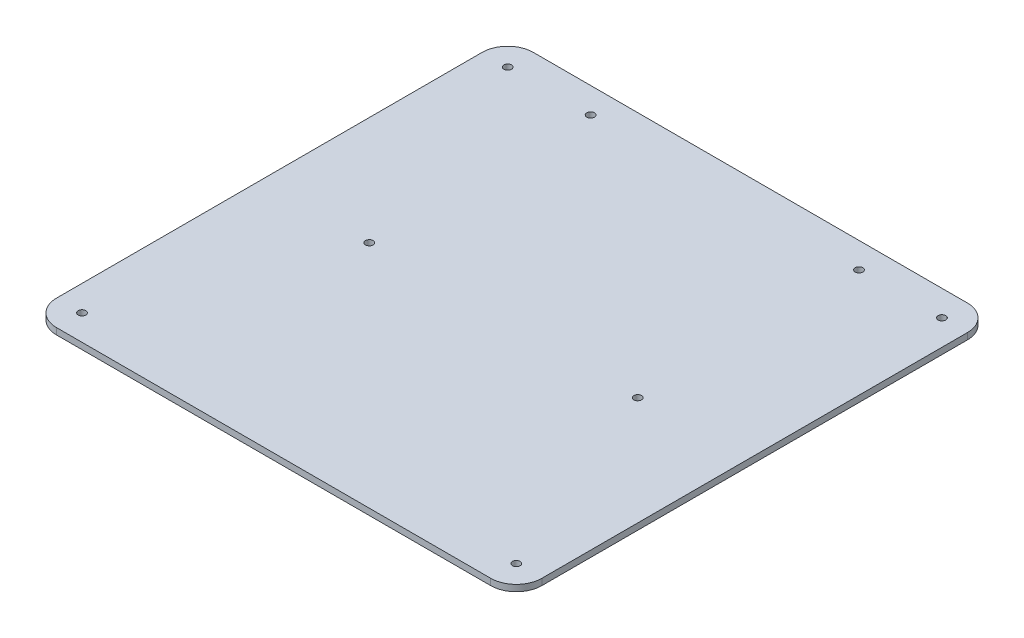
ISO-10303-21;
HEADER;
FILE_DESCRIPTION(('STEP AP214'),'2;1');
FILE_NAME('part.step','',(''),(''),'','','');
FILE_SCHEMA(('AUTOMOTIVE_DESIGN { 1 0 10303 214 1 1 1 1 }'));
ENDSEC;
DATA;
#1=APPLICATION_CONTEXT('core data for automotive mechanical design processes');
#2=APPLICATION_PROTOCOL_DEFINITION('international standard','automotive_design',2000,#1);
#3=PRODUCT_CONTEXT('',#1,'mechanical');
#4=PRODUCT('Part','Part','',(#3));
#5=PRODUCT_RELATED_PRODUCT_CATEGORY('part','',(#4));
#6=PRODUCT_DEFINITION_FORMATION('','',#4);
#7=PRODUCT_DEFINITION_CONTEXT('part definition',#1,'design');
#8=PRODUCT_DEFINITION('design','',#6,#7);
#9=PRODUCT_DEFINITION_SHAPE('','',#8);
#10=(LENGTH_UNIT() NAMED_UNIT(*) SI_UNIT(.MILLI.,.METRE.));
#11=(NAMED_UNIT(*) PLANE_ANGLE_UNIT() SI_UNIT($,.RADIAN.));
#12=(NAMED_UNIT(*) SI_UNIT($,.STERADIAN.) SOLID_ANGLE_UNIT());
#13=UNCERTAINTY_MEASURE_WITH_UNIT(LENGTH_MEASURE(1.E-05),#10,'distance_accuracy_value','');
#14=(GEOMETRIC_REPRESENTATION_CONTEXT(3) GLOBAL_UNCERTAINTY_ASSIGNED_CONTEXT((#13)) GLOBAL_UNIT_ASSIGNED_CONTEXT((#10,
#11,#12)) REPRESENTATION_CONTEXT('',''));
#15=CARTESIAN_POINT('',(0.,0.,0.));
#16=DIRECTION('',(0.,0.,1.));
#17=DIRECTION('',(1.,0.,0.));
#18=AXIS2_PLACEMENT_3D('',#15,#16,#17);
#19=CARTESIAN_POINT('',(-168.099479224988,69.6371137303564,-29.9177020021704));
#20=DIRECTION('',(0.,-1.,0.));
#21=DIRECTION('',(0.,0.,-1.));
#22=AXIS2_PLACEMENT_3D('',#19,#20,#21);
#23=PLANE('',#22);
#24=CARTESIAN_POINT('',(-168.099479224988,69.6371137303564,-29.9177020021704));
#25=DIRECTION('',(0.,1.,0.));
#26=DIRECTION('',(0.,0.,-1.));
#27=AXIS2_PLACEMENT_3D('',#24,#25,#26);
#28=CIRCLE('',#27,10.);
#29=CARTESIAN_POINT('',(-168.099479224988,69.6371137303564,-39.9177020021704));
#30=VERTEX_POINT('',#29);
#31=CARTESIAN_POINT('',(-178.099479224988,69.6371137303564,-29.9177020021704));
#32=VERTEX_POINT('',#31);
#33=EDGE_CURVE('E145',#30,#32,#28,.T.);
#34=ORIENTED_EDGE('',*,*,#33,.T.);
#35=DIRECTION('',(0.,0.,1.));
#36=VECTOR('',#35,1.);
#37=CARTESIAN_POINT('',(-178.099479224988,69.6371137303564,-29.9177020021704));
#38=LINE('',#37,#36);
#39=CARTESIAN_POINT('',(-178.099479224988,69.6371137303564,136.727321583706));
#40=VERTEX_POINT('',#39);
#41=EDGE_CURVE('E93',#32,#40,#38,.T.);
#42=ORIENTED_EDGE('',*,*,#41,.T.);
#43=CARTESIAN_POINT('',(-168.099479224988,69.6371137303564,136.727321583706));
#44=DIRECTION('',(0.,1.,0.));
#45=DIRECTION('',(0.,0.,1.));
#46=AXIS2_PLACEMENT_3D('',#43,#44,#45);
#47=CIRCLE('',#46,10.);
#48=CARTESIAN_POINT('',(-168.099479224988,69.6371137303564,146.727321583706));
#49=VERTEX_POINT('',#48);
#50=EDGE_CURVE('E160',#40,#49,#47,.T.);
#51=ORIENTED_EDGE('',*,*,#50,.T.);
#52=DIRECTION('',(1.,0.,0.));
#53=VECTOR('',#52,1.);
#54=CARTESIAN_POINT('',(1.90052077501147,69.6371137303564,146.727321583706));
#55=LINE('',#54,#53);
#56=CARTESIAN_POINT('',(1.90052077501147,69.6371137303564,146.727321583706));
#57=VERTEX_POINT('',#56);
#58=EDGE_CURVE('E173',#49,#57,#55,.T.);
#59=ORIENTED_EDGE('',*,*,#58,.T.);
#60=CARTESIAN_POINT('',(1.90052077501154,69.6371137303564,136.727321583706));
#61=DIRECTION('',(0.,1.,0.));
#62=DIRECTION('',(0.,0.,1.));
#63=AXIS2_PLACEMENT_3D('',#60,#61,#62);
#64=CIRCLE('',#63,10.);
#65=CARTESIAN_POINT('',(11.9005207750115,69.6371137303564,136.727321583706));
#66=VERTEX_POINT('',#65);
#67=EDGE_CURVE('E112',#57,#66,#64,.T.);
#68=ORIENTED_EDGE('',*,*,#67,.T.);
#69=DIRECTION('',(0.,0.,-1.));
#70=VECTOR('',#69,1.);
#71=CARTESIAN_POINT('',(11.9005207750115,69.6371137303564,-29.9177020021704));
#72=LINE('',#71,#70);
#73=CARTESIAN_POINT('',(11.9005207750115,69.6371137303564,-29.9177020021704));
#74=VERTEX_POINT('',#73);
#75=EDGE_CURVE('E106',#66,#74,#72,.T.);
#76=ORIENTED_EDGE('',*,*,#75,.T.);
#77=CARTESIAN_POINT('',(1.90052077501151,69.6371137303564,-29.9177020021704));
#78=DIRECTION('',(0.,1.,0.));
#79=DIRECTION('',(0.,0.,-1.));
#80=AXIS2_PLACEMENT_3D('',#77,#78,#79);
#81=CIRCLE('',#80,10.);
#82=CARTESIAN_POINT('',(1.90052077501151,69.6371137303564,-39.9177020021704));
#83=VERTEX_POINT('',#82);
#84=EDGE_CURVE('E110',#74,#83,#81,.T.);
#85=ORIENTED_EDGE('',*,*,#84,.T.);
#86=DIRECTION('',(-1.,0.,0.));
#87=VECTOR('',#86,1.);
#88=CARTESIAN_POINT('',(1.90052077501151,69.6371137303564,-39.9177020021704));
#89=LINE('',#88,#87);
#90=EDGE_CURVE('E50',#83,#30,#89,.T.);
#91=ORIENTED_EDGE('',*,*,#90,.T.);
#92=EDGE_LOOP('',(#34,#42,#51,#59,#68,#76,#85,#91));
#93=FACE_BOUND('',#92,.T.);
#94=CARTESIAN_POINT('',(-30.5685157154369,69.6371137303564,-29.9177020021704));
#95=DIRECTION('',(0.,1.,0.));
#96=DIRECTION('',(0.,0.,1.));
#97=AXIS2_PLACEMENT_3D('',#94,#95,#96);
#98=CIRCLE('',#97,1.5);
#99=CARTESIAN_POINT('',(-30.5685157154369,69.6371137303564,-28.4177020021704));
#100=VERTEX_POINT('',#99);
#101=EDGE_CURVE('E134',#100,#100,#98,.T.);
#102=ORIENTED_EDGE('',*,*,#101,.F.);
#103=EDGE_LOOP('',(#102));
#104=FACE_BOUND('',#103,.T.);
#105=CARTESIAN_POINT('',(-135.63044273454,69.6371137303564,-29.9177020021704));
#106=DIRECTION('',(0.,1.,0.));
#107=DIRECTION('',(0.,0.,1.));
#108=AXIS2_PLACEMENT_3D('',#105,#106,#107);
#109=CIRCLE('',#108,1.5);
#110=CARTESIAN_POINT('',(-135.63044273454,69.6371137303564,-28.4177020021704));
#111=VERTEX_POINT('',#110);
#112=EDGE_CURVE('E182',#111,#111,#109,.T.);
#113=ORIENTED_EDGE('',*,*,#112,.F.);
#114=EDGE_LOOP('',(#113));
#115=FACE_BOUND('',#114,.T.);
#116=CARTESIAN_POINT('',(-135.63044273454,69.6371137303564,56.7273215837061));
#117=DIRECTION('',(0.,1.,0.));
#118=DIRECTION('',(0.,0.,1.));
#119=AXIS2_PLACEMENT_3D('',#116,#117,#118);
#120=CIRCLE('',#119,1.5);
#121=CARTESIAN_POINT('',(-135.63044273454,69.6371137303564,58.2273215837061));
#122=VERTEX_POINT('',#121);
#123=EDGE_CURVE('E188',#122,#122,#120,.T.);
#124=ORIENTED_EDGE('',*,*,#123,.F.);
#125=EDGE_LOOP('',(#124));
#126=FACE_BOUND('',#125,.T.);
#127=CARTESIAN_POINT('',(-30.5685157154369,69.6371137303564,56.7273215837061));
#128=DIRECTION('',(0.,1.,0.));
#129=DIRECTION('',(0.,0.,1.));
#130=AXIS2_PLACEMENT_3D('',#127,#128,#129);
#131=CIRCLE('',#130,1.5);
#132=CARTESIAN_POINT('',(-30.5685157154369,69.6371137303564,58.2273215837061));
#133=VERTEX_POINT('',#132);
#134=EDGE_CURVE('E194',#133,#133,#131,.T.);
#135=ORIENTED_EDGE('',*,*,#134,.F.);
#136=EDGE_LOOP('',(#135));
#137=FACE_BOUND('',#136,.T.);
#138=CARTESIAN_POINT('',(1.90052077501151,69.6371137303564,-29.9177020021704));
#139=DIRECTION('',(0.,1.,0.));
#140=DIRECTION('',(0.,0.,1.));
#141=AXIS2_PLACEMENT_3D('',#138,#139,#140);
#142=CIRCLE('',#141,1.5);
#143=CARTESIAN_POINT('',(1.90052077501151,69.6371137303564,-28.4177020021704));
#144=VERTEX_POINT('',#143);
#145=EDGE_CURVE('E200',#144,#144,#142,.T.);
#146=ORIENTED_EDGE('',*,*,#145,.F.);
#147=EDGE_LOOP('',(#146));
#148=FACE_BOUND('',#147,.T.);
#149=CARTESIAN_POINT('',(1.90052077501154,69.6371137303564,136.727321583706));
#150=DIRECTION('',(0.,1.,0.));
#151=DIRECTION('',(0.,0.,1.));
#152=AXIS2_PLACEMENT_3D('',#149,#150,#151);
#153=CIRCLE('',#152,1.5);
#154=CARTESIAN_POINT('',(1.90052077501154,69.6371137303564,138.227321583706));
#155=VERTEX_POINT('',#154);
#156=EDGE_CURVE('E206',#155,#155,#153,.T.);
#157=ORIENTED_EDGE('',*,*,#156,.F.);
#158=EDGE_LOOP('',(#157));
#159=FACE_BOUND('',#158,.T.);
#160=CARTESIAN_POINT('',(-168.099479224988,69.6371137303564,136.727321583706));
#161=DIRECTION('',(0.,1.,0.));
#162=DIRECTION('',(0.,0.,1.));
#163=AXIS2_PLACEMENT_3D('',#160,#161,#162);
#164=CIRCLE('',#163,1.5);
#165=CARTESIAN_POINT('',(-168.099479224988,69.6371137303564,138.227321583706));
#166=VERTEX_POINT('',#165);
#167=EDGE_CURVE('E212',#166,#166,#164,.T.);
#168=ORIENTED_EDGE('',*,*,#167,.F.);
#169=EDGE_LOOP('',(#168));
#170=FACE_BOUND('',#169,.T.);
#171=CARTESIAN_POINT('',(-168.099479224988,69.6371137303564,-29.9177020021704));
#172=DIRECTION('',(0.,1.,0.));
#173=DIRECTION('',(0.,0.,1.));
#174=AXIS2_PLACEMENT_3D('',#171,#172,#173);
#175=CIRCLE('',#174,1.5);
#176=CARTESIAN_POINT('',(-168.099479224988,69.6371137303564,-28.4177020021704));
#177=VERTEX_POINT('',#176);
#178=EDGE_CURVE('E218',#177,#177,#175,.T.);
#179=ORIENTED_EDGE('',*,*,#178,.F.);
#180=EDGE_LOOP('',(#179));
#181=FACE_BOUND('',#180,.T.);
#182=ADVANCED_FACE('F33',(#93,#104,#115,#126,#137,#148,#159,#170,#181),#23,.F.);
#183=CARTESIAN_POINT('',(-168.099479224988,67.1371137303564,-29.9177020021704));
#184=DIRECTION('',(0.,-1.,0.));
#185=DIRECTION('',(0.,0.,-1.));
#186=AXIS2_PLACEMENT_3D('',#183,#184,#185);
#187=PLANE('',#186);
#188=CARTESIAN_POINT('',(-168.099479224988,67.1371137303564,136.727321583706));
#189=DIRECTION('',(0.,1.,0.));
#190=DIRECTION('',(0.,0.,1.));
#191=AXIS2_PLACEMENT_3D('',#188,#189,#190);
#192=CIRCLE('',#191,1.5);
#193=CARTESIAN_POINT('',(-168.099479224988,67.1371137303564,138.227321583706));
#194=VERTEX_POINT('',#193);
#195=EDGE_CURVE('E215',#194,#194,#192,.T.);
#196=ORIENTED_EDGE('',*,*,#195,.T.);
#197=EDGE_LOOP('',(#196));
#198=FACE_BOUND('',#197,.T.);
#199=CARTESIAN_POINT('',(1.90052077501151,67.1371137303564,-29.9177020021704));
#200=DIRECTION('',(0.,1.,0.));
#201=DIRECTION('',(0.,0.,1.));
#202=AXIS2_PLACEMENT_3D('',#199,#200,#201);
#203=CIRCLE('',#202,1.5);
#204=CARTESIAN_POINT('',(1.90052077501151,67.1371137303564,-28.4177020021704));
#205=VERTEX_POINT('',#204);
#206=EDGE_CURVE('E203',#205,#205,#203,.T.);
#207=ORIENTED_EDGE('',*,*,#206,.T.);
#208=EDGE_LOOP('',(#207));
#209=FACE_BOUND('',#208,.T.);
#210=CARTESIAN_POINT('',(-135.63044273454,67.1371137303564,56.7273215837061));
#211=DIRECTION('',(0.,1.,0.));
#212=DIRECTION('',(0.,0.,1.));
#213=AXIS2_PLACEMENT_3D('',#210,#211,#212);
#214=CIRCLE('',#213,1.5);
#215=CARTESIAN_POINT('',(-135.63044273454,67.1371137303564,58.2273215837061));
#216=VERTEX_POINT('',#215);
#217=EDGE_CURVE('E191',#216,#216,#214,.T.);
#218=ORIENTED_EDGE('',*,*,#217,.T.);
#219=EDGE_LOOP('',(#218));
#220=FACE_BOUND('',#219,.T.);
#221=CARTESIAN_POINT('',(-30.5685157154369,67.1371137303564,-29.9177020021704));
#222=DIRECTION('',(0.,1.,0.));
#223=DIRECTION('',(0.,0.,1.));
#224=AXIS2_PLACEMENT_3D('',#221,#222,#223);
#225=CIRCLE('',#224,1.5);
#226=CARTESIAN_POINT('',(-30.5685157154369,67.1371137303564,-28.4177020021704));
#227=VERTEX_POINT('',#226);
#228=EDGE_CURVE('E179',#227,#227,#225,.T.);
#229=ORIENTED_EDGE('',*,*,#228,.T.);
#230=EDGE_LOOP('',(#229));
#231=FACE_BOUND('',#230,.T.);
#232=CARTESIAN_POINT('',(-168.099479224988,67.1371137303564,-29.9177020021704));
#233=DIRECTION('',(0.,1.,0.));
#234=DIRECTION('',(0.,0.,-1.));
#235=AXIS2_PLACEMENT_3D('',#232,#233,#234);
#236=CIRCLE('',#235,10.);
#237=CARTESIAN_POINT('',(-168.099479224988,67.1371137303564,-39.9177020021704));
#238=VERTEX_POINT('',#237);
#239=CARTESIAN_POINT('',(-178.099479224988,67.1371137303564,-29.9177020021704));
#240=VERTEX_POINT('',#239);
#241=EDGE_CURVE('E130',#238,#240,#236,.T.);
#242=ORIENTED_EDGE('',*,*,#241,.F.);
#243=DIRECTION('',(-1.,0.,0.));
#244=VECTOR('',#243,1.);
#245=CARTESIAN_POINT('',(1.90052077501151,67.1371137303564,-39.9177020021704));
#246=LINE('',#245,#244);
#247=CARTESIAN_POINT('',(1.90052077501151,67.1371137303564,-39.9177020021704));
#248=VERTEX_POINT('',#247);
#249=EDGE_CURVE('E85',#248,#238,#246,.T.);
#250=ORIENTED_EDGE('',*,*,#249,.F.);
#251=CARTESIAN_POINT('',(1.90052077501151,67.1371137303564,-29.9177020021704));
#252=DIRECTION('',(0.,1.,0.));
#253=DIRECTION('',(0.,0.,-1.));
#254=AXIS2_PLACEMENT_3D('',#251,#252,#253);
#255=CIRCLE('',#254,10.);
#256=CARTESIAN_POINT('',(11.9005207750115,67.1371137303564,-29.9177020021704));
#257=VERTEX_POINT('',#256);
#258=EDGE_CURVE('E79',#257,#248,#255,.T.);
#259=ORIENTED_EDGE('',*,*,#258,.F.);
#260=DIRECTION('',(0.,0.,-1.));
#261=VECTOR('',#260,1.);
#262=CARTESIAN_POINT('',(11.9005207750115,67.1371137303564,-29.9177020021704));
#263=LINE('',#262,#261);
#264=CARTESIAN_POINT('',(11.9005207750115,67.1371137303564,136.727321583706));
#265=VERTEX_POINT('',#264);
#266=EDGE_CURVE('E120',#265,#257,#263,.T.);
#267=ORIENTED_EDGE('',*,*,#266,.F.);
#268=CARTESIAN_POINT('',(1.90052077501154,67.1371137303564,136.727321583706));
#269=DIRECTION('',(0.,1.,0.));
#270=DIRECTION('',(0.,0.,1.));
#271=AXIS2_PLACEMENT_3D('',#268,#269,#270);
#272=CIRCLE('',#271,10.);
#273=CARTESIAN_POINT('',(1.90052077501147,67.1371137303564,146.727321583706));
#274=VERTEX_POINT('',#273);
#275=EDGE_CURVE('E140',#274,#265,#272,.T.);
#276=ORIENTED_EDGE('',*,*,#275,.F.);
#277=DIRECTION('',(1.,0.,0.));
#278=VECTOR('',#277,1.);
#279=CARTESIAN_POINT('',(1.90052077501147,67.1371137303564,146.727321583706));
#280=LINE('',#279,#278);
#281=CARTESIAN_POINT('',(-168.099479224988,67.1371137303564,146.727321583706));
#282=VERTEX_POINT('',#281);
#283=EDGE_CURVE('E138',#282,#274,#280,.T.);
#284=ORIENTED_EDGE('',*,*,#283,.F.);
#285=CARTESIAN_POINT('',(-168.099479224988,67.1371137303564,136.727321583706));
#286=DIRECTION('',(0.,1.,0.));
#287=DIRECTION('',(0.,0.,1.));
#288=AXIS2_PLACEMENT_3D('',#285,#286,#287);
#289=CIRCLE('',#288,10.);
#290=CARTESIAN_POINT('',(-178.099479224988,67.1371137303564,136.727321583706));
#291=VERTEX_POINT('',#290);
#292=EDGE_CURVE('E136',#291,#282,#289,.T.);
#293=ORIENTED_EDGE('',*,*,#292,.F.);
#294=DIRECTION('',(0.,0.,1.));
#295=VECTOR('',#294,1.);
#296=CARTESIAN_POINT('',(-178.099479224988,67.1371137303564,-29.9177020021704));
#297=LINE('',#296,#295);
#298=EDGE_CURVE('E133',#240,#291,#297,.T.);
#299=ORIENTED_EDGE('',*,*,#298,.F.);
#300=EDGE_LOOP('',(#242,#250,#259,#267,#276,#284,#293,#299));
#301=FACE_BOUND('',#300,.T.);
#302=CARTESIAN_POINT('',(-135.63044273454,67.1371137303564,-29.9177020021704));
#303=DIRECTION('',(0.,1.,0.));
#304=DIRECTION('',(0.,0.,1.));
#305=AXIS2_PLACEMENT_3D('',#302,#303,#304);
#306=CIRCLE('',#305,1.5);
#307=CARTESIAN_POINT('',(-135.63044273454,67.1371137303564,-28.4177020021704));
#308=VERTEX_POINT('',#307);
#309=EDGE_CURVE('E185',#308,#308,#306,.T.);
#310=ORIENTED_EDGE('',*,*,#309,.T.);
#311=EDGE_LOOP('',(#310));
#312=FACE_BOUND('',#311,.T.);
#313=CARTESIAN_POINT('',(-30.5685157154369,67.1371137303564,56.7273215837061));
#314=DIRECTION('',(0.,1.,0.));
#315=DIRECTION('',(0.,0.,1.));
#316=AXIS2_PLACEMENT_3D('',#313,#314,#315);
#317=CIRCLE('',#316,1.5);
#318=CARTESIAN_POINT('',(-30.5685157154369,67.1371137303564,58.2273215837061));
#319=VERTEX_POINT('',#318);
#320=EDGE_CURVE('E197',#319,#319,#317,.T.);
#321=ORIENTED_EDGE('',*,*,#320,.T.);
#322=EDGE_LOOP('',(#321));
#323=FACE_BOUND('',#322,.T.);
#324=CARTESIAN_POINT('',(1.90052077501154,67.1371137303564,136.727321583706));
#325=DIRECTION('',(0.,1.,0.));
#326=DIRECTION('',(0.,0.,1.));
#327=AXIS2_PLACEMENT_3D('',#324,#325,#326);
#328=CIRCLE('',#327,1.5);
#329=CARTESIAN_POINT('',(1.90052077501154,67.1371137303564,138.227321583706));
#330=VERTEX_POINT('',#329);
#331=EDGE_CURVE('E209',#330,#330,#328,.T.);
#332=ORIENTED_EDGE('',*,*,#331,.T.);
#333=EDGE_LOOP('',(#332));
#334=FACE_BOUND('',#333,.T.);
#335=CARTESIAN_POINT('',(-168.099479224988,67.1371137303564,-29.9177020021704));
#336=DIRECTION('',(0.,1.,0.));
#337=DIRECTION('',(0.,0.,1.));
#338=AXIS2_PLACEMENT_3D('',#335,#336,#337);
#339=CIRCLE('',#338,1.5);
#340=CARTESIAN_POINT('',(-168.099479224988,67.1371137303564,-28.4177020021704));
#341=VERTEX_POINT('',#340);
#342=EDGE_CURVE('E221',#341,#341,#339,.T.);
#343=ORIENTED_EDGE('',*,*,#342,.T.);
#344=EDGE_LOOP('',(#343));
#345=FACE_BOUND('',#344,.T.);
#346=ADVANCED_FACE('F164',(#198,#209,#220,#231,#301,#312,#323,#334,#345),#187,.T.);
#347=CARTESIAN_POINT('',(-168.099479224988,69.6371137303564,-29.9177020021704));
#348=DIRECTION('',(0.,-1.,0.));
#349=DIRECTION('',(0.,0.,-1.));
#350=AXIS2_PLACEMENT_3D('',#347,#348,#349);
#351=CYLINDRICAL_SURFACE('',#350,10.);
#352=ORIENTED_EDGE('',*,*,#241,.T.);
#353=DIRECTION('',(0.,-1.,0.));
#354=VECTOR('',#353,1.);
#355=CARTESIAN_POINT('',(-178.099479224988,69.6371137303564,-29.9177020021704));
#356=LINE('',#355,#354);
#357=EDGE_CURVE('E11',#32,#240,#356,.T.);
#358=ORIENTED_EDGE('',*,*,#357,.F.);
#359=ORIENTED_EDGE('',*,*,#33,.F.);
#360=DIRECTION('',(0.,-1.,0.));
#361=VECTOR('',#360,1.);
#362=CARTESIAN_POINT('',(-168.099479224988,69.6371137303564,-39.9177020021704));
#363=LINE('',#362,#361);
#364=EDGE_CURVE('E126',#30,#238,#363,.T.);
#365=ORIENTED_EDGE('',*,*,#364,.T.);
#366=EDGE_LOOP('',(#352,#358,#359,#365));
#367=FACE_BOUND('',#366,.T.);
#368=ADVANCED_FACE('F35',(#367),#351,.T.);
#369=CARTESIAN_POINT('',(-178.099479224988,69.6371137303564,-29.9177020021704));
#370=DIRECTION('',(1.,0.,0.));
#371=DIRECTION('',(0.,0.,-1.));
#372=AXIS2_PLACEMENT_3D('',#369,#370,#371);
#373=PLANE('',#372);
#374=ORIENTED_EDGE('',*,*,#298,.T.);
#375=DIRECTION('',(0.,-1.,0.));
#376=VECTOR('',#375,1.);
#377=CARTESIAN_POINT('',(-178.099479224988,69.6371137303564,136.727321583706));
#378=LINE('',#377,#376);
#379=EDGE_CURVE('E42',#40,#291,#378,.T.);
#380=ORIENTED_EDGE('',*,*,#379,.F.);
#381=ORIENTED_EDGE('',*,*,#41,.F.);
#382=ORIENTED_EDGE('',*,*,#357,.T.);
#383=EDGE_LOOP('',(#374,#380,#381,#382));
#384=FACE_BOUND('',#383,.T.);
#385=ADVANCED_FACE('F253',(#384),#373,.F.);
#386=CARTESIAN_POINT('',(-168.099479224988,69.6371137303564,136.727321583706));
#387=DIRECTION('',(0.,-1.,0.));
#388=DIRECTION('',(0.,0.,-1.));
#389=AXIS2_PLACEMENT_3D('',#386,#387,#388);
#390=CYLINDRICAL_SURFACE('',#389,10.);
#391=ORIENTED_EDGE('',*,*,#292,.T.);
#392=DIRECTION('',(0.,-1.,0.));
#393=VECTOR('',#392,1.);
#394=CARTESIAN_POINT('',(-168.099479224988,69.6371137303564,146.727321583706));
#395=LINE('',#394,#393);
#396=EDGE_CURVE('E152',#49,#282,#395,.T.);
#397=ORIENTED_EDGE('',*,*,#396,.F.);
#398=ORIENTED_EDGE('',*,*,#50,.F.);
#399=ORIENTED_EDGE('',*,*,#379,.T.);
#400=EDGE_LOOP('',(#391,#397,#398,#399));
#401=FACE_BOUND('',#400,.T.);
#402=ADVANCED_FACE('F158',(#401),#390,.T.);
#403=CARTESIAN_POINT('',(1.90052077501147,69.6371137303564,146.727321583706));
#404=DIRECTION('',(0.,0.,-1.));
#405=DIRECTION('',(-1.,0.,0.));
#406=AXIS2_PLACEMENT_3D('',#403,#404,#405);
#407=PLANE('',#406);
#408=ORIENTED_EDGE('',*,*,#283,.T.);
#409=DIRECTION('',(0.,-1.,0.));
#410=VECTOR('',#409,1.);
#411=CARTESIAN_POINT('',(1.90052077501147,69.6371137303564,146.727321583706));
#412=LINE('',#411,#410);
#413=EDGE_CURVE('E149',#57,#274,#412,.T.);
#414=ORIENTED_EDGE('',*,*,#413,.F.);
#415=ORIENTED_EDGE('',*,*,#58,.F.);
#416=ORIENTED_EDGE('',*,*,#396,.T.);
#417=EDGE_LOOP('',(#408,#414,#415,#416));
#418=FACE_BOUND('',#417,.T.);
#419=ADVANCED_FACE('F169',(#418),#407,.F.);
#420=CARTESIAN_POINT('',(1.90052077501154,69.6371137303564,136.727321583706));
#421=DIRECTION('',(0.,-1.,0.));
#422=DIRECTION('',(0.,0.,-1.));
#423=AXIS2_PLACEMENT_3D('',#420,#421,#422);
#424=CYLINDRICAL_SURFACE('',#423,10.);
#425=ORIENTED_EDGE('',*,*,#275,.T.);
#426=DIRECTION('',(0.,-1.,0.));
#427=VECTOR('',#426,1.);
#428=CARTESIAN_POINT('',(11.9005207750115,69.6371137303564,136.727321583706));
#429=LINE('',#428,#427);
#430=EDGE_CURVE('E121',#66,#265,#429,.T.);
#431=ORIENTED_EDGE('',*,*,#430,.F.);
#432=ORIENTED_EDGE('',*,*,#67,.F.);
#433=ORIENTED_EDGE('',*,*,#413,.T.);
#434=EDGE_LOOP('',(#425,#431,#432,#433));
#435=FACE_BOUND('',#434,.T.);
#436=ADVANCED_FACE('F172',(#435),#424,.T.);
#437=CARTESIAN_POINT('',(11.9005207750115,69.6371137303564,-29.9177020021704));
#438=DIRECTION('',(-1.,0.,0.));
#439=DIRECTION('',(0.,0.,1.));
#440=AXIS2_PLACEMENT_3D('',#437,#438,#439);
#441=PLANE('',#440);
#442=ORIENTED_EDGE('',*,*,#266,.T.);
#443=DIRECTION('',(0.,-1.,0.));
#444=VECTOR('',#443,1.);
#445=CARTESIAN_POINT('',(11.9005207750115,69.6371137303564,-29.9177020021704));
#446=LINE('',#445,#444);
#447=EDGE_CURVE('E117',#74,#257,#446,.T.);
#448=ORIENTED_EDGE('',*,*,#447,.F.);
#449=ORIENTED_EDGE('',*,*,#75,.F.);
#450=ORIENTED_EDGE('',*,*,#430,.T.);
#451=EDGE_LOOP('',(#442,#448,#449,#450));
#452=FACE_BOUND('',#451,.T.);
#453=ADVANCED_FACE('F118',(#452),#441,.F.);
#454=CARTESIAN_POINT('',(1.90052077501151,69.6371137303564,-29.9177020021704));
#455=DIRECTION('',(0.,-1.,0.));
#456=DIRECTION('',(0.,0.,-1.));
#457=AXIS2_PLACEMENT_3D('',#454,#455,#456);
#458=CYLINDRICAL_SURFACE('',#457,10.);
#459=ORIENTED_EDGE('',*,*,#258,.T.);
#460=DIRECTION('',(0.,-1.,0.));
#461=VECTOR('',#460,1.);
#462=CARTESIAN_POINT('',(1.90052077501151,69.6371137303564,-39.9177020021704));
#463=LINE('',#462,#461);
#464=EDGE_CURVE('E122',#83,#248,#463,.T.);
#465=ORIENTED_EDGE('',*,*,#464,.F.);
#466=ORIENTED_EDGE('',*,*,#84,.F.);
#467=ORIENTED_EDGE('',*,*,#447,.T.);
#468=EDGE_LOOP('',(#459,#465,#466,#467));
#469=FACE_BOUND('',#468,.T.);
#470=ADVANCED_FACE('F124',(#469),#458,.T.);
#471=CARTESIAN_POINT('',(1.90052077501151,69.6371137303564,-39.9177020021704));
#472=DIRECTION('',(0.,0.,1.));
#473=DIRECTION('',(1.,0.,0.));
#474=AXIS2_PLACEMENT_3D('',#471,#472,#473);
#475=PLANE('',#474);
#476=ORIENTED_EDGE('',*,*,#249,.T.);
#477=ORIENTED_EDGE('',*,*,#364,.F.);
#478=ORIENTED_EDGE('',*,*,#90,.F.);
#479=ORIENTED_EDGE('',*,*,#464,.T.);
#480=EDGE_LOOP('',(#476,#477,#478,#479));
#481=FACE_BOUND('',#480,.T.);
#482=ADVANCED_FACE('F241',(#481),#475,.F.);
#483=CARTESIAN_POINT('',(-30.5685157154369,69.6371137303564,-29.9177020021704));
#484=DIRECTION('',(0.,-1.,0.));
#485=DIRECTION('',(0.,0.,-1.));
#486=AXIS2_PLACEMENT_3D('',#483,#484,#485);
#487=CYLINDRICAL_SURFACE('',#486,1.5);
#488=ORIENTED_EDGE('',*,*,#101,.T.);
#489=EDGE_LOOP('',(#488));
#490=FACE_BOUND('',#489,.T.);
#491=ORIENTED_EDGE('',*,*,#228,.F.);
#492=EDGE_LOOP('',(#491));
#493=FACE_BOUND('',#492,.T.);
#494=ADVANCED_FACE('F238',(#490,#493),#487,.F.);
#495=CARTESIAN_POINT('',(-135.63044273454,69.6371137303564,-29.9177020021704));
#496=DIRECTION('',(0.,-1.,0.));
#497=DIRECTION('',(0.,0.,-1.));
#498=AXIS2_PLACEMENT_3D('',#495,#496,#497);
#499=CYLINDRICAL_SURFACE('',#498,1.5);
#500=ORIENTED_EDGE('',*,*,#112,.T.);
#501=EDGE_LOOP('',(#500));
#502=FACE_BOUND('',#501,.T.);
#503=ORIENTED_EDGE('',*,*,#309,.F.);
#504=EDGE_LOOP('',(#503));
#505=FACE_BOUND('',#504,.T.);
#506=ADVANCED_FACE('F317',(#502,#505),#499,.F.);
#507=CARTESIAN_POINT('',(-135.63044273454,69.6371137303564,56.7273215837061));
#508=DIRECTION('',(0.,-1.,0.));
#509=DIRECTION('',(0.,0.,-1.));
#510=AXIS2_PLACEMENT_3D('',#507,#508,#509);
#511=CYLINDRICAL_SURFACE('',#510,1.5);
#512=ORIENTED_EDGE('',*,*,#123,.T.);
#513=EDGE_LOOP('',(#512));
#514=FACE_BOUND('',#513,.T.);
#515=ORIENTED_EDGE('',*,*,#217,.F.);
#516=EDGE_LOOP('',(#515));
#517=FACE_BOUND('',#516,.T.);
#518=ADVANCED_FACE('F325',(#514,#517),#511,.F.);
#519=CARTESIAN_POINT('',(-30.5685157154369,69.6371137303564,56.7273215837061));
#520=DIRECTION('',(0.,-1.,0.));
#521=DIRECTION('',(0.,0.,-1.));
#522=AXIS2_PLACEMENT_3D('',#519,#520,#521);
#523=CYLINDRICAL_SURFACE('',#522,1.5);
#524=ORIENTED_EDGE('',*,*,#134,.T.);
#525=EDGE_LOOP('',(#524));
#526=FACE_BOUND('',#525,.T.);
#527=ORIENTED_EDGE('',*,*,#320,.F.);
#528=EDGE_LOOP('',(#527));
#529=FACE_BOUND('',#528,.T.);
#530=ADVANCED_FACE('F333',(#526,#529),#523,.F.);
#531=CARTESIAN_POINT('',(1.90052077501151,69.6371137303564,-29.9177020021704));
#532=DIRECTION('',(0.,-1.,0.));
#533=DIRECTION('',(0.,0.,-1.));
#534=AXIS2_PLACEMENT_3D('',#531,#532,#533);
#535=CYLINDRICAL_SURFACE('',#534,1.5);
#536=ORIENTED_EDGE('',*,*,#145,.T.);
#537=EDGE_LOOP('',(#536));
#538=FACE_BOUND('',#537,.T.);
#539=ORIENTED_EDGE('',*,*,#206,.F.);
#540=EDGE_LOOP('',(#539));
#541=FACE_BOUND('',#540,.T.);
#542=ADVANCED_FACE('F342',(#538,#541),#535,.F.);
#543=CARTESIAN_POINT('',(1.90052077501154,69.6371137303564,136.727321583706));
#544=DIRECTION('',(0.,-1.,0.));
#545=DIRECTION('',(0.,0.,-1.));
#546=AXIS2_PLACEMENT_3D('',#543,#544,#545);
#547=CYLINDRICAL_SURFACE('',#546,1.5);
#548=ORIENTED_EDGE('',*,*,#156,.T.);
#549=EDGE_LOOP('',(#548));
#550=FACE_BOUND('',#549,.T.);
#551=ORIENTED_EDGE('',*,*,#331,.F.);
#552=EDGE_LOOP('',(#551));
#553=FACE_BOUND('',#552,.T.);
#554=ADVANCED_FACE('F351',(#550,#553),#547,.F.);
#555=CARTESIAN_POINT('',(-168.099479224988,69.6371137303564,136.727321583706));
#556=DIRECTION('',(0.,-1.,0.));
#557=DIRECTION('',(0.,0.,-1.));
#558=AXIS2_PLACEMENT_3D('',#555,#556,#557);
#559=CYLINDRICAL_SURFACE('',#558,1.5);
#560=ORIENTED_EDGE('',*,*,#167,.T.);
#561=EDGE_LOOP('',(#560));
#562=FACE_BOUND('',#561,.T.);
#563=ORIENTED_EDGE('',*,*,#195,.F.);
#564=EDGE_LOOP('',(#563));
#565=FACE_BOUND('',#564,.T.);
#566=ADVANCED_FACE('F360',(#562,#565),#559,.F.);
#567=CARTESIAN_POINT('',(-168.099479224988,69.6371137303564,-29.9177020021704));
#568=DIRECTION('',(0.,-1.,0.));
#569=DIRECTION('',(0.,0.,-1.));
#570=AXIS2_PLACEMENT_3D('',#567,#568,#569);
#571=CYLINDRICAL_SURFACE('',#570,1.5);
#572=ORIENTED_EDGE('',*,*,#178,.T.);
#573=EDGE_LOOP('',(#572));
#574=FACE_BOUND('',#573,.T.);
#575=ORIENTED_EDGE('',*,*,#342,.F.);
#576=EDGE_LOOP('',(#575));
#577=FACE_BOUND('',#576,.T.);
#578=ADVANCED_FACE('F227',(#574,#577),#571,.F.);
#579=CLOSED_SHELL('',(#182,#346,#368,#385,#402,#419,#436,#453,#470,#482,#494,#506,#518,#530,
#542,#554,#566,#578));
#580=MANIFOLD_SOLID_BREP('B2',#579);
#581=ADVANCED_BREP_SHAPE_REPRESENTATION('',(#18,#580),#14);
#582=SHAPE_DEFINITION_REPRESENTATION(#9,#581);
ENDSEC;
END-ISO-10303-21;
